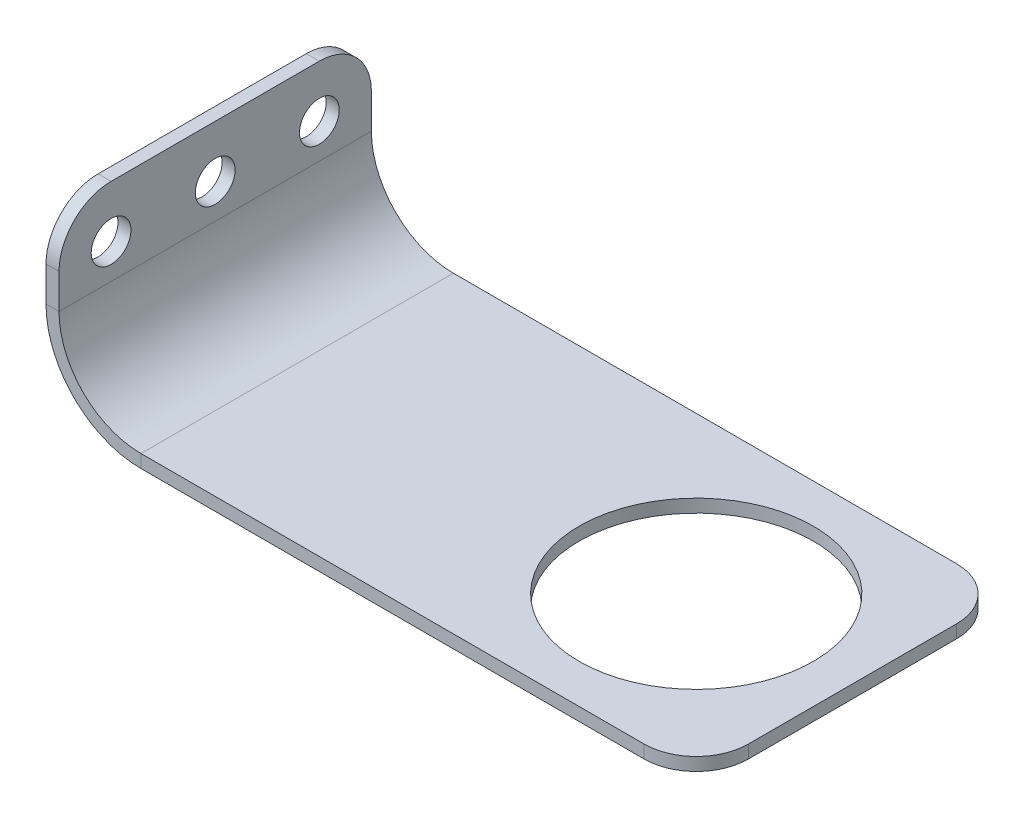
ISO-10303-21;
HEADER;
FILE_DESCRIPTION(('STEP AP214'),'2;1');
FILE_NAME('part.step','',(''),(''),'','','');
FILE_SCHEMA(('AUTOMOTIVE_DESIGN { 1 0 10303 214 1 1 1 1 }'));
ENDSEC;
DATA;
#1=APPLICATION_CONTEXT('core data for automotive mechanical design processes');
#2=APPLICATION_PROTOCOL_DEFINITION('international standard','automotive_design',2000,#1);
#3=PRODUCT_CONTEXT('',#1,'mechanical');
#4=PRODUCT('Part','Part','',(#3));
#5=PRODUCT_RELATED_PRODUCT_CATEGORY('part','',(#4));
#6=PRODUCT_DEFINITION_FORMATION('','',#4);
#7=PRODUCT_DEFINITION_CONTEXT('part definition',#1,'design');
#8=PRODUCT_DEFINITION('design','',#6,#7);
#9=PRODUCT_DEFINITION_SHAPE('','',#8);
#10=(LENGTH_UNIT() NAMED_UNIT(*) SI_UNIT(.MILLI.,.METRE.));
#11=(NAMED_UNIT(*) PLANE_ANGLE_UNIT() SI_UNIT($,.RADIAN.));
#12=(NAMED_UNIT(*) SI_UNIT($,.STERADIAN.) SOLID_ANGLE_UNIT());
#13=UNCERTAINTY_MEASURE_WITH_UNIT(LENGTH_MEASURE(1.E-05),#10,'distance_accuracy_value','');
#14=(GEOMETRIC_REPRESENTATION_CONTEXT(3) GLOBAL_UNCERTAINTY_ASSIGNED_CONTEXT((#13)) GLOBAL_UNIT_ASSIGNED_CONTEXT((#10,
#11,#12)) REPRESENTATION_CONTEXT('',''));
#15=CARTESIAN_POINT('',(0.,0.,0.));
#16=DIRECTION('',(0.,0.,1.));
#17=DIRECTION('',(1.,0.,0.));
#18=AXIS2_PLACEMENT_3D('',#15,#16,#17);
#19=CARTESIAN_POINT('',(15.9398914261713,22.1601085738288,0.));
#20=DIRECTION('',(1.,0.,0.));
#21=DIRECTION('',(0.,0.,1.));
#22=AXIS2_PLACEMENT_3D('',#19,#20,#21);
#23=PLANE('',#22);
#24=CARTESIAN_POINT('',(15.9398914261712,15.8101085738288,-31.75));
#25=DIRECTION('',(1.,0.,0.));
#26=DIRECTION('',(0.,0.,1.));
#27=AXIS2_PLACEMENT_3D('',#24,#25,#26);
#28=CIRCLE('',#27,2.425);
#29=CARTESIAN_POINT('',(15.9398914261712,15.8101085738288,-29.325));
#30=VERTEX_POINT('',#29);
#31=EDGE_CURVE('E225',#30,#30,#28,.T.);
#32=ORIENTED_EDGE('',*,*,#31,.T.);
#33=EDGE_LOOP('',(#32));
#34=FACE_BOUND('',#33,.T.);
#35=CARTESIAN_POINT('',(15.9398914261712,15.8101085738288,-19.05));
#36=DIRECTION('',(1.,0.,0.));
#37=DIRECTION('',(0.,0.,1.));
#38=AXIS2_PLACEMENT_3D('',#35,#36,#37);
#39=CIRCLE('',#38,2.425);
#40=CARTESIAN_POINT('',(15.9398914261712,15.8101085738288,-16.625));
#41=VERTEX_POINT('',#40);
#42=EDGE_CURVE('E222',#41,#41,#39,.T.);
#43=ORIENTED_EDGE('',*,*,#42,.T.);
#44=EDGE_LOOP('',(#43));
#45=FACE_BOUND('',#44,.T.);
#46=CARTESIAN_POINT('',(15.9398914261712,15.8101085738288,-6.35));
#47=DIRECTION('',(1.,0.,0.));
#48=DIRECTION('',(0.,0.,1.));
#49=AXIS2_PLACEMENT_3D('',#46,#47,#48);
#50=CIRCLE('',#49,2.425);
#51=CARTESIAN_POINT('',(15.9398914261712,15.8101085738288,-3.925));
#52=VERTEX_POINT('',#51);
#53=EDGE_CURVE('E219',#52,#52,#50,.T.);
#54=ORIENTED_EDGE('',*,*,#53,.T.);
#55=EDGE_LOOP('',(#54));
#56=FACE_BOUND('',#55,.T.);
#57=DIRECTION('',(0.,-1.,0.));
#58=VECTOR('',#57,1.);
#59=CARTESIAN_POINT('',(15.9398914261713,22.1601085738288,-38.1));
#60=LINE('',#59,#58);
#61=CARTESIAN_POINT('',(15.9398914261712,15.8101085738288,-38.1));
#62=VERTEX_POINT('',#61);
#63=CARTESIAN_POINT('',(15.9398914261712,11.5875,-38.1));
#64=VERTEX_POINT('',#63);
#65=EDGE_CURVE('E61',#62,#64,#60,.T.);
#66=ORIENTED_EDGE('',*,*,#65,.T.);
#67=DIRECTION('',(0.,0.,1.));
#68=VECTOR('',#67,1.);
#69=CARTESIAN_POINT('',(15.9398914261712,11.5875,0.));
#70=LINE('',#69,#68);
#71=CARTESIAN_POINT('',(15.9398914261712,11.5875,0.));
#72=VERTEX_POINT('',#71);
#73=EDGE_CURVE('E53',#64,#72,#70,.T.);
#74=ORIENTED_EDGE('',*,*,#73,.T.);
#75=DIRECTION('',(0.,-1.,0.));
#76=VECTOR('',#75,1.);
#77=CARTESIAN_POINT('',(15.9398914261713,22.1601085738288,0.));
#78=LINE('',#77,#76);
#79=CARTESIAN_POINT('',(15.9398914261712,15.8101085738288,0.));
#80=VERTEX_POINT('',#79);
#81=EDGE_CURVE('E69',#80,#72,#78,.T.);
#82=ORIENTED_EDGE('',*,*,#81,.F.);
#83=CARTESIAN_POINT('',(15.9398914261712,15.8101085738288,-6.35));
#84=DIRECTION('',(1.,0.,0.));
#85=DIRECTION('',(0.,0.,1.));
#86=AXIS2_PLACEMENT_3D('',#83,#84,#85);
#87=CIRCLE('',#86,6.35);
#88=CARTESIAN_POINT('',(15.9398914261713,22.1601085738288,-6.35));
#89=VERTEX_POINT('',#88);
#90=EDGE_CURVE('E228',#89,#80,#87,.T.);
#91=ORIENTED_EDGE('',*,*,#90,.F.);
#92=DIRECTION('',(0.,0.,1.));
#93=VECTOR('',#92,1.);
#94=CARTESIAN_POINT('',(15.9398914261713,22.1601085738288,0.));
#95=LINE('',#94,#93);
#96=CARTESIAN_POINT('',(15.9398914261713,22.1601085738288,-31.75));
#97=VERTEX_POINT('',#96);
#98=EDGE_CURVE('E231',#89,#97,#95,.F.);
#99=ORIENTED_EDGE('',*,*,#98,.T.);
#100=CARTESIAN_POINT('',(15.9398914261712,15.8101085738288,-31.75));
#101=DIRECTION('',(1.,0.,0.));
#102=DIRECTION('',(0.,0.,1.));
#103=AXIS2_PLACEMENT_3D('',#100,#101,#102);
#104=CIRCLE('',#103,6.35);
#105=EDGE_CURVE('E234',#62,#97,#104,.T.);
#106=ORIENTED_EDGE('',*,*,#105,.F.);
#107=EDGE_LOOP('',(#66,#74,#82,#91,#99,#106));
#108=FACE_BOUND('',#107,.T.);
#109=ADVANCED_FACE('F44',(#34,#45,#56,#108),#23,.F.);
#110=CARTESIAN_POINT('',(17.5273914261713,22.1601085738288,-38.1));
#111=DIRECTION('',(0.,0.,1.));
#112=DIRECTION('',(0.,-1.,0.));
#113=AXIS2_PLACEMENT_3D('',#110,#111,#112);
#114=PLANE('',#113);
#115=DIRECTION('',(1.,0.,0.));
#116=VECTOR('',#115,1.);
#117=CARTESIAN_POINT('',(17.5273914261712,11.5875,-38.1));
#118=LINE('',#117,#116);
#119=CARTESIAN_POINT('',(17.5273914261712,11.5875,-38.1));
#120=VERTEX_POINT('',#119);
#121=EDGE_CURVE('E12',#64,#120,#118,.T.);
#122=ORIENTED_EDGE('',*,*,#121,.F.);
#123=ORIENTED_EDGE('',*,*,#65,.F.);
#124=DIRECTION('',(1.,0.,0.));
#125=VECTOR('',#124,1.);
#126=CARTESIAN_POINT('',(17.5273914261712,15.8101085738288,-38.1));
#127=LINE('',#126,#125);
#128=CARTESIAN_POINT('',(17.5273914261712,15.8101085738288,-38.1));
#129=VERTEX_POINT('',#128);
#130=EDGE_CURVE('E243',#62,#129,#127,.T.);
#131=ORIENTED_EDGE('',*,*,#130,.T.);
#132=DIRECTION('',(0.,-1.,0.));
#133=VECTOR('',#132,1.);
#134=CARTESIAN_POINT('',(17.5273914261713,22.1601085738288,-38.1));
#135=LINE('',#134,#133);
#136=EDGE_CURVE('E209',#129,#120,#135,.T.);
#137=ORIENTED_EDGE('',*,*,#136,.T.);
#138=EDGE_LOOP('',(#122,#123,#131,#137));
#139=FACE_BOUND('',#138,.T.);
#140=ADVANCED_FACE('F46',(#139),#114,.F.);
#141=CARTESIAN_POINT('',(17.5273914261712,15.8101085738288,-31.75));
#142=DIRECTION('',(1.,0.,0.));
#143=DIRECTION('',(0.,0.,1.));
#144=AXIS2_PLACEMENT_3D('',#141,#142,#143);
#145=CYLINDRICAL_SURFACE('',#144,6.35);
#146=ORIENTED_EDGE('',*,*,#130,.F.);
#147=ORIENTED_EDGE('',*,*,#105,.T.);
#148=DIRECTION('',(1.,0.,0.));
#149=VECTOR('',#148,1.);
#150=CARTESIAN_POINT('',(17.5273914261713,22.1601085738288,-31.75));
#151=LINE('',#150,#149);
#152=CARTESIAN_POINT('',(17.5273914261713,22.1601085738288,-31.75));
#153=VERTEX_POINT('',#152);
#154=EDGE_CURVE('E241',#97,#153,#151,.T.);
#155=ORIENTED_EDGE('',*,*,#154,.T.);
#156=CARTESIAN_POINT('',(17.5273914261712,15.8101085738288,-31.75));
#157=DIRECTION('',(1.,0.,0.));
#158=DIRECTION('',(0.,0.,1.));
#159=AXIS2_PLACEMENT_3D('',#156,#157,#158);
#160=CIRCLE('',#159,6.35);
#161=EDGE_CURVE('E210',#129,#153,#160,.T.);
#162=ORIENTED_EDGE('',*,*,#161,.F.);
#163=EDGE_LOOP('',(#146,#147,#155,#162));
#164=FACE_BOUND('',#163,.T.);
#165=ADVANCED_FACE('F304',(#164),#145,.T.);
#166=CARTESIAN_POINT('',(17.5273914261713,22.1601085738288,0.));
#167=DIRECTION('',(0.,-1.,0.));
#168=DIRECTION('',(0.,0.,-1.));
#169=AXIS2_PLACEMENT_3D('',#166,#167,#168);
#170=PLANE('',#169);
#171=ORIENTED_EDGE('',*,*,#154,.F.);
#172=ORIENTED_EDGE('',*,*,#98,.F.);
#173=DIRECTION('',(1.,0.,0.));
#174=VECTOR('',#173,1.);
#175=CARTESIAN_POINT('',(17.5273914261713,22.1601085738288,-6.35));
#176=LINE('',#175,#174);
#177=CARTESIAN_POINT('',(17.5273914261713,22.1601085738288,-6.35));
#178=VERTEX_POINT('',#177);
#179=EDGE_CURVE('E239',#89,#178,#176,.T.);
#180=ORIENTED_EDGE('',*,*,#179,.T.);
#181=DIRECTION('',(0.,0.,-1.));
#182=VECTOR('',#181,1.);
#183=CARTESIAN_POINT('',(17.5273914261713,22.1601085738288,0.));
#184=LINE('',#183,#182);
#185=EDGE_CURVE('E213',#178,#153,#184,.T.);
#186=ORIENTED_EDGE('',*,*,#185,.T.);
#187=EDGE_LOOP('',(#171,#172,#180,#186));
#188=FACE_BOUND('',#187,.T.);
#189=ADVANCED_FACE('F302',(#188),#170,.F.);
#190=CARTESIAN_POINT('',(17.5273914261712,15.8101085738288,-6.35));
#191=DIRECTION('',(1.,0.,0.));
#192=DIRECTION('',(0.,0.,1.));
#193=AXIS2_PLACEMENT_3D('',#190,#191,#192);
#194=CYLINDRICAL_SURFACE('',#193,6.35);
#195=ORIENTED_EDGE('',*,*,#179,.F.);
#196=ORIENTED_EDGE('',*,*,#90,.T.);
#197=DIRECTION('',(1.,0.,0.));
#198=VECTOR('',#197,1.);
#199=CARTESIAN_POINT('',(17.5273914261712,15.8101085738288,0.));
#200=LINE('',#199,#198);
#201=CARTESIAN_POINT('',(17.5273914261712,15.8101085738288,0.));
#202=VERTEX_POINT('',#201);
#203=EDGE_CURVE('E237',#80,#202,#200,.T.);
#204=ORIENTED_EDGE('',*,*,#203,.T.);
#205=CARTESIAN_POINT('',(17.5273914261712,15.8101085738288,-6.35));
#206=DIRECTION('',(1.,0.,0.));
#207=DIRECTION('',(0.,0.,1.));
#208=AXIS2_PLACEMENT_3D('',#205,#206,#207);
#209=CIRCLE('',#208,6.35);
#210=EDGE_CURVE('E216',#178,#202,#209,.T.);
#211=ORIENTED_EDGE('',*,*,#210,.F.);
#212=EDGE_LOOP('',(#195,#196,#204,#211));
#213=FACE_BOUND('',#212,.T.);
#214=ADVANCED_FACE('F299',(#213),#194,.T.);
#215=CARTESIAN_POINT('',(17.5273914261713,22.1601085738288,0.));
#216=DIRECTION('',(0.,0.,1.));
#217=DIRECTION('',(0.,-1.,0.));
#218=AXIS2_PLACEMENT_3D('',#215,#216,#217);
#219=PLANE('',#218);
#220=DIRECTION('',(-1.,0.,0.));
#221=VECTOR('',#220,1.);
#222=CARTESIAN_POINT('',(17.5273914261712,11.5875,0.));
#223=LINE('',#222,#221);
#224=CARTESIAN_POINT('',(17.5273914261712,11.5875,0.));
#225=VERTEX_POINT('',#224);
#226=EDGE_CURVE('E246',#225,#72,#223,.T.);
#227=ORIENTED_EDGE('',*,*,#226,.F.);
#228=DIRECTION('',(0.,-1.,0.));
#229=VECTOR('',#228,1.);
#230=CARTESIAN_POINT('',(17.5273914261713,22.1601085738288,0.));
#231=LINE('',#230,#229);
#232=EDGE_CURVE('E48',#202,#225,#231,.T.);
#233=ORIENTED_EDGE('',*,*,#232,.F.);
#234=ORIENTED_EDGE('',*,*,#203,.F.);
#235=ORIENTED_EDGE('',*,*,#81,.T.);
#236=EDGE_LOOP('',(#227,#233,#234,#235));
#237=FACE_BOUND('',#236,.T.);
#238=ADVANCED_FACE('F293',(#237),#219,.T.);
#239=CARTESIAN_POINT('',(17.5273914261712,15.8101085738288,-6.35));
#240=DIRECTION('',(1.,0.,0.));
#241=DIRECTION('',(0.,0.,1.));
#242=AXIS2_PLACEMENT_3D('',#239,#240,#241);
#243=CYLINDRICAL_SURFACE('',#242,2.425);
#244=CARTESIAN_POINT('',(17.5273914261712,15.8101085738288,-6.35));
#245=DIRECTION('',(1.,0.,0.));
#246=DIRECTION('',(0.,0.,1.));
#247=AXIS2_PLACEMENT_3D('',#244,#245,#246);
#248=CIRCLE('',#247,2.425);
#249=CARTESIAN_POINT('',(17.5273914261712,15.8101085738288,-3.925));
#250=VERTEX_POINT('',#249);
#251=EDGE_CURVE('E200',#250,#250,#248,.T.);
#252=ORIENTED_EDGE('',*,*,#251,.T.);
#253=EDGE_LOOP('',(#252));
#254=FACE_BOUND('',#253,.T.);
#255=ORIENTED_EDGE('',*,*,#53,.F.);
#256=EDGE_LOOP('',(#255));
#257=FACE_BOUND('',#256,.T.);
#258=ADVANCED_FACE('F320',(#254,#257),#243,.F.);
#259=CARTESIAN_POINT('',(17.5273914261712,15.8101085738288,-19.05));
#260=DIRECTION('',(1.,0.,0.));
#261=DIRECTION('',(0.,0.,1.));
#262=AXIS2_PLACEMENT_3D('',#259,#260,#261);
#263=CYLINDRICAL_SURFACE('',#262,2.425);
#264=CARTESIAN_POINT('',(17.5273914261712,15.8101085738288,-19.05));
#265=DIRECTION('',(1.,0.,0.));
#266=DIRECTION('',(0.,0.,1.));
#267=AXIS2_PLACEMENT_3D('',#264,#265,#266);
#268=CIRCLE('',#267,2.425);
#269=CARTESIAN_POINT('',(17.5273914261712,15.8101085738288,-16.625));
#270=VERTEX_POINT('',#269);
#271=EDGE_CURVE('E203',#270,#270,#268,.T.);
#272=ORIENTED_EDGE('',*,*,#271,.T.);
#273=EDGE_LOOP('',(#272));
#274=FACE_BOUND('',#273,.T.);
#275=ORIENTED_EDGE('',*,*,#42,.F.);
#276=EDGE_LOOP('',(#275));
#277=FACE_BOUND('',#276,.T.);
#278=ADVANCED_FACE('F329',(#274,#277),#263,.F.);
#279=CARTESIAN_POINT('',(17.5273914261712,15.8101085738288,-31.75));
#280=DIRECTION('',(1.,0.,0.));
#281=DIRECTION('',(0.,0.,1.));
#282=AXIS2_PLACEMENT_3D('',#279,#280,#281);
#283=CYLINDRICAL_SURFACE('',#282,2.425);
#284=CARTESIAN_POINT('',(17.5273914261712,15.8101085738288,-31.75));
#285=DIRECTION('',(1.,0.,0.));
#286=DIRECTION('',(0.,0.,1.));
#287=AXIS2_PLACEMENT_3D('',#284,#285,#286);
#288=CIRCLE('',#287,2.425);
#289=CARTESIAN_POINT('',(17.5273914261712,15.8101085738288,-29.325));
#290=VERTEX_POINT('',#289);
#291=EDGE_CURVE('E206',#290,#290,#288,.T.);
#292=ORIENTED_EDGE('',*,*,#291,.T.);
#293=EDGE_LOOP('',(#292));
#294=FACE_BOUND('',#293,.T.);
#295=ORIENTED_EDGE('',*,*,#31,.F.);
#296=EDGE_LOOP('',(#295));
#297=FACE_BOUND('',#296,.T.);
#298=ADVANCED_FACE('F322',(#294,#297),#283,.F.);
#299=CARTESIAN_POINT('',(17.5273914261713,22.1601085738288,0.));
#300=DIRECTION('',(1.,0.,0.));
#301=DIRECTION('',(0.,0.,1.));
#302=AXIS2_PLACEMENT_3D('',#299,#300,#301);
#303=PLANE('',#302);
#304=DIRECTION('',(0.,0.,1.));
#305=VECTOR('',#304,1.);
#306=CARTESIAN_POINT('',(17.5273914261712,11.5875,0.));
#307=LINE('',#306,#305);
#308=EDGE_CURVE('E156',#120,#225,#307,.T.);
#309=ORIENTED_EDGE('',*,*,#308,.F.);
#310=ORIENTED_EDGE('',*,*,#136,.F.);
#311=ORIENTED_EDGE('',*,*,#161,.T.);
#312=ORIENTED_EDGE('',*,*,#185,.F.);
#313=ORIENTED_EDGE('',*,*,#210,.T.);
#314=ORIENTED_EDGE('',*,*,#232,.T.);
#315=EDGE_LOOP('',(#309,#310,#311,#312,#313,#314));
#316=FACE_BOUND('',#315,.T.);
#317=ORIENTED_EDGE('',*,*,#251,.F.);
#318=EDGE_LOOP('',(#317));
#319=FACE_BOUND('',#318,.T.);
#320=ORIENTED_EDGE('',*,*,#271,.F.);
#321=EDGE_LOOP('',(#320));
#322=FACE_BOUND('',#321,.T.);
#323=ORIENTED_EDGE('',*,*,#291,.F.);
#324=EDGE_LOOP('',(#323));
#325=FACE_BOUND('',#324,.T.);
#326=ADVANCED_FACE('F294',(#316,#319,#322,#325),#303,.T.);
#327=CARTESIAN_POINT('',(88.9,1.5875,-31.75));
#328=DIRECTION('',(0.,1.,0.));
#329=DIRECTION('',(0.,0.,1.));
#330=AXIS2_PLACEMENT_3D('',#327,#328,#329);
#331=CYLINDRICAL_SURFACE('',#330,6.35);
#332=CARTESIAN_POINT('',(88.9,0.,-31.75));
#333=DIRECTION('',(0.,1.,0.));
#334=DIRECTION('',(0.,0.,1.));
#335=AXIS2_PLACEMENT_3D('',#332,#333,#334);
#336=CIRCLE('',#335,6.35);
#337=CARTESIAN_POINT('',(95.25,0.,-31.75));
#338=VERTEX_POINT('',#337);
#339=CARTESIAN_POINT('',(88.9,0.,-38.1));
#340=VERTEX_POINT('',#339);
#341=EDGE_CURVE('E196',#338,#340,#336,.T.);
#342=ORIENTED_EDGE('',*,*,#341,.T.);
#343=DIRECTION('',(0.,1.,0.));
#344=VECTOR('',#343,1.);
#345=CARTESIAN_POINT('',(88.9,1.5875,-38.1));
#346=LINE('',#345,#344);
#347=CARTESIAN_POINT('',(88.9,1.5875,-38.1));
#348=VERTEX_POINT('',#347);
#349=EDGE_CURVE('E193',#340,#348,#346,.T.);
#350=ORIENTED_EDGE('',*,*,#349,.T.);
#351=CARTESIAN_POINT('',(88.9,1.5875,-31.75));
#352=DIRECTION('',(0.,1.,0.));
#353=DIRECTION('',(0.,0.,1.));
#354=AXIS2_PLACEMENT_3D('',#351,#352,#353);
#355=CIRCLE('',#354,6.35);
#356=CARTESIAN_POINT('',(95.25,1.5875,-31.75));
#357=VERTEX_POINT('',#356);
#358=EDGE_CURVE('E147',#357,#348,#355,.T.);
#359=ORIENTED_EDGE('',*,*,#358,.F.);
#360=DIRECTION('',(0.,1.,0.));
#361=VECTOR('',#360,1.);
#362=CARTESIAN_POINT('',(95.25,1.5875,-31.75));
#363=LINE('',#362,#361);
#364=EDGE_CURVE('E188',#338,#357,#363,.T.);
#365=ORIENTED_EDGE('',*,*,#364,.F.);
#366=EDGE_LOOP('',(#342,#350,#359,#365));
#367=FACE_BOUND('',#366,.T.);
#368=ADVANCED_FACE('F280',(#367),#331,.T.);
#369=CARTESIAN_POINT('',(95.25,1.5875,0.));
#370=DIRECTION('',(1.,0.,0.));
#371=DIRECTION('',(0.,0.,-1.));
#372=AXIS2_PLACEMENT_3D('',#369,#370,#371);
#373=PLANE('',#372);
#374=DIRECTION('',(0.,1.,0.));
#375=VECTOR('',#374,1.);
#376=CARTESIAN_POINT('',(95.25,1.5875,-6.35));
#377=LINE('',#376,#375);
#378=CARTESIAN_POINT('',(95.25,0.,-6.35));
#379=VERTEX_POINT('',#378);
#380=CARTESIAN_POINT('',(95.25,1.5875,-6.35));
#381=VERTEX_POINT('',#380);
#382=EDGE_CURVE('E183',#379,#381,#377,.T.);
#383=ORIENTED_EDGE('',*,*,#382,.F.);
#384=DIRECTION('',(0.,0.,1.));
#385=VECTOR('',#384,1.);
#386=CARTESIAN_POINT('',(95.25,0.,0.));
#387=LINE('',#386,#385);
#388=EDGE_CURVE('E190',#379,#338,#387,.F.);
#389=ORIENTED_EDGE('',*,*,#388,.T.);
#390=ORIENTED_EDGE('',*,*,#364,.T.);
#391=DIRECTION('',(0.,0.,-1.));
#392=VECTOR('',#391,1.);
#393=CARTESIAN_POINT('',(95.25,1.5875,0.));
#394=LINE('',#393,#392);
#395=EDGE_CURVE('E177',#381,#357,#394,.T.);
#396=ORIENTED_EDGE('',*,*,#395,.F.);
#397=EDGE_LOOP('',(#383,#389,#390,#396));
#398=FACE_BOUND('',#397,.T.);
#399=ADVANCED_FACE('F327',(#398),#373,.T.);
#400=CARTESIAN_POINT('',(88.9,1.5875,-6.35));
#401=DIRECTION('',(0.,1.,0.));
#402=DIRECTION('',(0.,0.,1.));
#403=AXIS2_PLACEMENT_3D('',#400,#401,#402);
#404=CYLINDRICAL_SURFACE('',#403,6.35);
#405=DIRECTION('',(0.,1.,0.));
#406=VECTOR('',#405,1.);
#407=CARTESIAN_POINT('',(88.9,1.5875,0.));
#408=LINE('',#407,#406);
#409=CARTESIAN_POINT('',(88.9,0.,0.));
#410=VERTEX_POINT('',#409);
#411=CARTESIAN_POINT('',(88.9,1.5875,0.));
#412=VERTEX_POINT('',#411);
#413=EDGE_CURVE('E173',#410,#412,#408,.T.);
#414=ORIENTED_EDGE('',*,*,#413,.F.);
#415=CARTESIAN_POINT('',(88.9,0.,-6.35));
#416=DIRECTION('',(0.,1.,0.));
#417=DIRECTION('',(0.,0.,1.));
#418=AXIS2_PLACEMENT_3D('',#415,#416,#417);
#419=CIRCLE('',#418,6.35);
#420=EDGE_CURVE('E185',#410,#379,#419,.T.);
#421=ORIENTED_EDGE('',*,*,#420,.T.);
#422=ORIENTED_EDGE('',*,*,#382,.T.);
#423=CARTESIAN_POINT('',(88.9,1.5875,-6.35));
#424=DIRECTION('',(0.,1.,0.));
#425=DIRECTION('',(0.,0.,1.));
#426=AXIS2_PLACEMENT_3D('',#423,#424,#425);
#427=CIRCLE('',#426,6.35);
#428=EDGE_CURVE('E175',#412,#381,#427,.T.);
#429=ORIENTED_EDGE('',*,*,#428,.F.);
#430=EDGE_LOOP('',(#414,#421,#422,#429));
#431=FACE_BOUND('',#430,.T.);
#432=ADVANCED_FACE('F387',(#431),#404,.T.);
#433=CARTESIAN_POINT('',(76.2,1.5875,-19.05));
#434=DIRECTION('',(0.,1.,0.));
#435=DIRECTION('',(0.,0.,1.));
#436=AXIS2_PLACEMENT_3D('',#433,#434,#435);
#437=CYLINDRICAL_SURFACE('',#436,14.2875);
#438=CARTESIAN_POINT('',(76.2,1.5875,-19.05));
#439=DIRECTION('',(0.,1.,0.));
#440=DIRECTION('',(0.,0.,1.));
#441=AXIS2_PLACEMENT_3D('',#438,#439,#440);
#442=CIRCLE('',#441,14.2875);
#443=CARTESIAN_POINT('',(76.2,1.5875,-4.76249999999999));
#444=VERTEX_POINT('',#443);
#445=EDGE_CURVE('E169',#444,#444,#442,.T.);
#446=ORIENTED_EDGE('',*,*,#445,.T.);
#447=EDGE_LOOP('',(#446));
#448=FACE_BOUND('',#447,.T.);
#449=CARTESIAN_POINT('',(76.2,0.,-19.05));
#450=DIRECTION('',(0.,1.,0.));
#451=DIRECTION('',(0.,0.,1.));
#452=AXIS2_PLACEMENT_3D('',#449,#450,#451);
#453=CIRCLE('',#452,14.2875);
#454=CARTESIAN_POINT('',(76.2,0.,-4.76249999999999));
#455=VERTEX_POINT('',#454);
#456=EDGE_CURVE('E268',#455,#455,#453,.T.);
#457=ORIENTED_EDGE('',*,*,#456,.F.);
#458=EDGE_LOOP('',(#457));
#459=FACE_BOUND('',#458,.T.);
#460=ADVANCED_FACE('F397',(#448,#459),#437,.F.);
#461=CARTESIAN_POINT('',(0.,1.5875,0.));
#462=DIRECTION('',(0.,1.,0.));
#463=DIRECTION('',(0.,0.,1.));
#464=AXIS2_PLACEMENT_3D('',#461,#462,#463);
#465=PLANE('',#464);
#466=ORIENTED_EDGE('',*,*,#445,.F.);
#467=EDGE_LOOP('',(#466));
#468=FACE_BOUND('',#467,.T.);
#469=DIRECTION('',(1.,0.,0.));
#470=VECTOR('',#469,1.);
#471=CARTESIAN_POINT('',(0.,1.5875,-38.1));
#472=LINE('',#471,#470);
#473=CARTESIAN_POINT('',(27.5273914261712,1.5875,-38.1));
#474=VERTEX_POINT('',#473);
#475=EDGE_CURVE('E167',#474,#348,#472,.T.);
#476=ORIENTED_EDGE('',*,*,#475,.F.);
#477=DIRECTION('',(0.,0.,1.));
#478=VECTOR('',#477,1.);
#479=CARTESIAN_POINT('',(27.5273914261712,1.5875,0.));
#480=LINE('',#479,#478);
#481=CARTESIAN_POINT('',(27.5273914261712,1.5875,0.));
#482=VERTEX_POINT('',#481);
#483=EDGE_CURVE('E154',#474,#482,#480,.T.);
#484=ORIENTED_EDGE('',*,*,#483,.T.);
#485=DIRECTION('',(1.,0.,0.));
#486=VECTOR('',#485,1.);
#487=CARTESIAN_POINT('',(0.,1.5875,0.));
#488=LINE('',#487,#486);
#489=EDGE_CURVE('E164',#482,#412,#488,.T.);
#490=ORIENTED_EDGE('',*,*,#489,.T.);
#491=ORIENTED_EDGE('',*,*,#428,.T.);
#492=ORIENTED_EDGE('',*,*,#395,.T.);
#493=ORIENTED_EDGE('',*,*,#358,.T.);
#494=EDGE_LOOP('',(#476,#484,#490,#491,#492,#493));
#495=FACE_BOUND('',#494,.T.);
#496=ADVANCED_FACE('F162',(#468,#495),#465,.T.);
#497=CARTESIAN_POINT('',(0.,1.5875,0.));
#498=DIRECTION('',(0.,0.,1.));
#499=DIRECTION('',(1.,0.,0.));
#500=AXIS2_PLACEMENT_3D('',#497,#498,#499);
#501=PLANE('',#500);
#502=ORIENTED_EDGE('',*,*,#489,.F.);
#503=DIRECTION('',(0.,-1.,0.));
#504=VECTOR('',#503,1.);
#505=CARTESIAN_POINT('',(27.5273914261712,1.5875,0.));
#506=LINE('',#505,#504);
#507=CARTESIAN_POINT('',(27.5273914261712,0.,0.));
#508=VERTEX_POINT('',#507);
#509=EDGE_CURVE('E136',#482,#508,#506,.T.);
#510=ORIENTED_EDGE('',*,*,#509,.T.);
#511=DIRECTION('',(1.,0.,0.));
#512=VECTOR('',#511,1.);
#513=CARTESIAN_POINT('',(0.,0.,0.));
#514=LINE('',#513,#512);
#515=EDGE_CURVE('E146',#508,#410,#514,.T.);
#516=ORIENTED_EDGE('',*,*,#515,.T.);
#517=ORIENTED_EDGE('',*,*,#413,.T.);
#518=EDGE_LOOP('',(#502,#510,#516,#517));
#519=FACE_BOUND('',#518,.T.);
#520=ADVANCED_FACE('F171',(#519),#501,.T.);
#521=CARTESIAN_POINT('',(0.,0.,0.));
#522=DIRECTION('',(0.,1.,0.));
#523=DIRECTION('',(0.,0.,1.));
#524=AXIS2_PLACEMENT_3D('',#521,#522,#523);
#525=PLANE('',#524);
#526=DIRECTION('',(0.,0.,1.));
#527=VECTOR('',#526,1.);
#528=CARTESIAN_POINT('',(27.5273914261712,0.,0.));
#529=LINE('',#528,#527);
#530=CARTESIAN_POINT('',(27.5273914261712,0.,-38.1));
#531=VERTEX_POINT('',#530);
#532=EDGE_CURVE('E157',#531,#508,#529,.T.);
#533=ORIENTED_EDGE('',*,*,#532,.F.);
#534=DIRECTION('',(1.,0.,0.));
#535=VECTOR('',#534,1.);
#536=CARTESIAN_POINT('',(0.,0.,-38.1));
#537=LINE('',#536,#535);
#538=EDGE_CURVE('E271',#531,#340,#537,.T.);
#539=ORIENTED_EDGE('',*,*,#538,.T.);
#540=ORIENTED_EDGE('',*,*,#341,.F.);
#541=ORIENTED_EDGE('',*,*,#388,.F.);
#542=ORIENTED_EDGE('',*,*,#420,.F.);
#543=ORIENTED_EDGE('',*,*,#515,.F.);
#544=EDGE_LOOP('',(#533,#539,#540,#541,#542,#543));
#545=FACE_BOUND('',#544,.T.);
#546=ORIENTED_EDGE('',*,*,#456,.T.);
#547=EDGE_LOOP('',(#546));
#548=FACE_BOUND('',#547,.T.);
#549=ADVANCED_FACE('F428',(#545,#548),#525,.F.);
#550=CARTESIAN_POINT('',(0.,1.5875,-38.1));
#551=DIRECTION('',(0.,0.,1.));
#552=DIRECTION('',(1.,0.,0.));
#553=AXIS2_PLACEMENT_3D('',#550,#551,#552);
#554=PLANE('',#553);
#555=ORIENTED_EDGE('',*,*,#538,.F.);
#556=DIRECTION('',(0.,1.,0.));
#557=VECTOR('',#556,1.);
#558=CARTESIAN_POINT('',(27.5273914261712,1.5875,-38.1));
#559=LINE('',#558,#557);
#560=EDGE_CURVE('E266',#531,#474,#559,.T.);
#561=ORIENTED_EDGE('',*,*,#560,.T.);
#562=ORIENTED_EDGE('',*,*,#475,.T.);
#563=ORIENTED_EDGE('',*,*,#349,.F.);
#564=EDGE_LOOP('',(#555,#561,#562,#563));
#565=FACE_BOUND('',#564,.T.);
#566=ADVANCED_FACE('F285',(#565),#554,.F.);
#567=CARTESIAN_POINT('',(27.5273914261712,11.5875,-38.1));
#568=DIRECTION('',(0.,0.,1.));
#569=DIRECTION('',(1.,0.,0.));
#570=AXIS2_PLACEMENT_3D('',#567,#568,#569);
#571=PLANE('',#570);
#572=ORIENTED_EDGE('',*,*,#560,.F.);
#573=CARTESIAN_POINT('',(27.5273914261712,11.5875,-38.1));
#574=DIRECTION('',(0.,0.,1.));
#575=DIRECTION('',(1.,0.,0.));
#576=AXIS2_PLACEMENT_3D('',#573,#574,#575);
#577=CIRCLE('',#576,11.5875);
#578=EDGE_CURVE('E260',#531,#64,#577,.F.);
#579=ORIENTED_EDGE('',*,*,#578,.T.);
#580=ORIENTED_EDGE('',*,*,#121,.T.);
#581=CARTESIAN_POINT('',(27.5273914261712,11.5875,-38.1));
#582=DIRECTION('',(0.,0.,-1.));
#583=DIRECTION('',(1.,0.,0.));
#584=AXIS2_PLACEMENT_3D('',#581,#582,#583);
#585=CIRCLE('',#584,10.);
#586=EDGE_CURVE('E158',#474,#120,#585,.T.);
#587=ORIENTED_EDGE('',*,*,#586,.F.);
#588=EDGE_LOOP('',(#572,#579,#580,#587));
#589=FACE_BOUND('',#588,.T.);
#590=ADVANCED_FACE('F258',(#589),#571,.F.);
#591=CARTESIAN_POINT('',(27.5273914261712,11.5875,0.));
#592=DIRECTION('',(0.,0.,-1.));
#593=DIRECTION('',(-1.,0.,0.));
#594=AXIS2_PLACEMENT_3D('',#591,#592,#593);
#595=PLANE('',#594);
#596=CARTESIAN_POINT('',(27.5273914261712,11.5875,0.));
#597=DIRECTION('',(0.,0.,1.));
#598=DIRECTION('',(1.,0.,0.));
#599=AXIS2_PLACEMENT_3D('',#596,#597,#598);
#600=CIRCLE('',#599,11.5875);
#601=EDGE_CURVE('E142',#72,#508,#600,.T.);
#602=ORIENTED_EDGE('',*,*,#601,.T.);
#603=ORIENTED_EDGE('',*,*,#509,.F.);
#604=CARTESIAN_POINT('',(27.5273914261712,11.5875,0.));
#605=DIRECTION('',(0.,0.,1.));
#606=DIRECTION('',(1.,0.,0.));
#607=AXIS2_PLACEMENT_3D('',#604,#605,#606);
#608=CIRCLE('',#607,10.);
#609=EDGE_CURVE('E140',#225,#482,#608,.T.);
#610=ORIENTED_EDGE('',*,*,#609,.F.);
#611=ORIENTED_EDGE('',*,*,#226,.T.);
#612=EDGE_LOOP('',(#602,#603,#610,#611));
#613=FACE_BOUND('',#612,.T.);
#614=ADVANCED_FACE('F138',(#613),#595,.F.);
#615=CARTESIAN_POINT('',(27.5273914261712,11.5875,-60.782419266322));
#616=DIRECTION('',(0.,0.,1.));
#617=DIRECTION('',(1.,0.,0.));
#618=AXIS2_PLACEMENT_3D('',#615,#616,#617);
#619=CYLINDRICAL_SURFACE('',#618,10.);
#620=ORIENTED_EDGE('',*,*,#308,.T.);
#621=ORIENTED_EDGE('',*,*,#609,.T.);
#622=ORIENTED_EDGE('',*,*,#483,.F.);
#623=ORIENTED_EDGE('',*,*,#586,.T.);
#624=EDGE_LOOP('',(#620,#621,#622,#623));
#625=FACE_BOUND('',#624,.T.);
#626=ADVANCED_FACE('F152',(#625),#619,.F.);
#627=CARTESIAN_POINT('',(27.5273914261712,11.5875,-60.782419266322));
#628=DIRECTION('',(0.,0.,1.));
#629=DIRECTION('',(1.,0.,0.));
#630=AXIS2_PLACEMENT_3D('',#627,#628,#629);
#631=CYLINDRICAL_SURFACE('',#630,11.5875);
#632=ORIENTED_EDGE('',*,*,#73,.F.);
#633=ORIENTED_EDGE('',*,*,#578,.F.);
#634=ORIENTED_EDGE('',*,*,#532,.T.);
#635=ORIENTED_EDGE('',*,*,#601,.F.);
#636=EDGE_LOOP('',(#632,#633,#634,#635));
#637=FACE_BOUND('',#636,.T.);
#638=ADVANCED_FACE('F288',(#637),#631,.T.);
#639=CLOSED_SHELL('',(#109,#140,#165,#189,#214,#238,#258,#278,#298,#326,#368,#399,#432,#460,
#496,#520,#549,#566,#590,#614,#626,#638));
#640=MANIFOLD_SOLID_BREP('B2',#639);
#641=ADVANCED_BREP_SHAPE_REPRESENTATION('',(#18,#640),#14);
#642=SHAPE_DEFINITION_REPRESENTATION(#9,#641);
ENDSEC;
END-ISO-10303-21;
